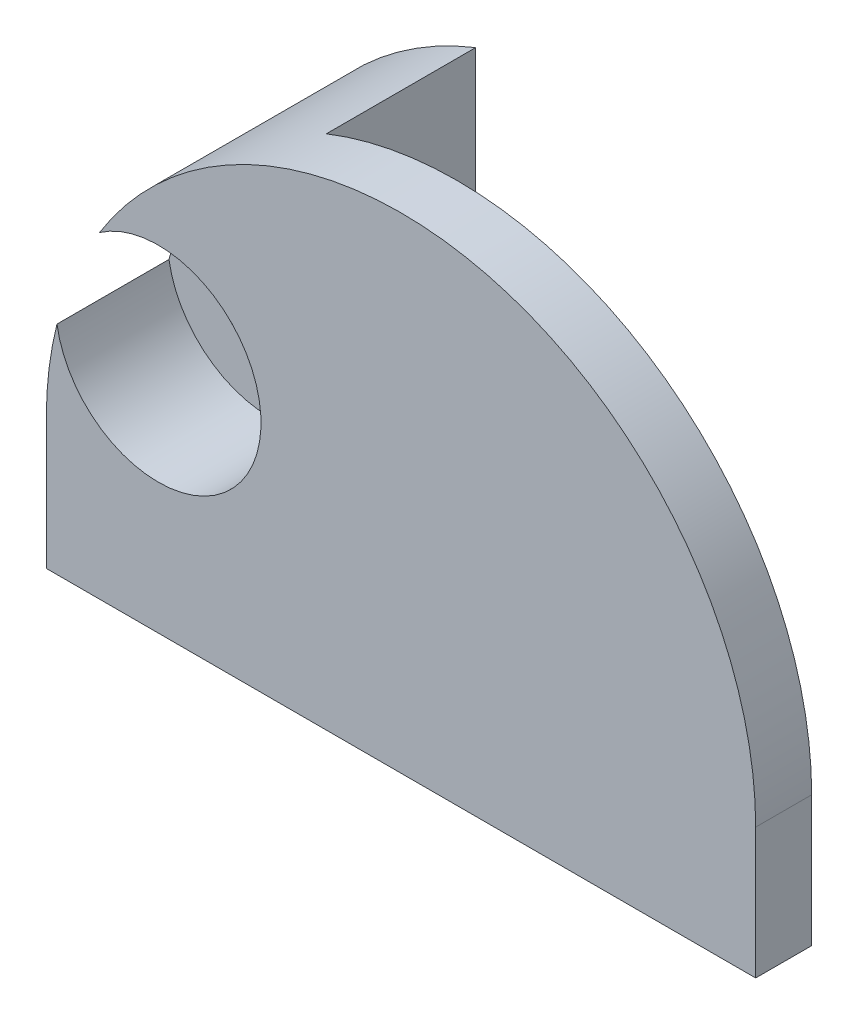
ISO-10303-21;
HEADER;
FILE_DESCRIPTION(('STEP AP214'),'2;1');
FILE_NAME('part.step','',(''),(''),'','','');
FILE_SCHEMA(('AUTOMOTIVE_DESIGN { 1 0 10303 214 1 1 1 1 }'));
ENDSEC;
DATA;
#1=APPLICATION_CONTEXT('core data for automotive mechanical design processes');
#2=APPLICATION_PROTOCOL_DEFINITION('international standard','automotive_design',2000,#1);
#3=PRODUCT_CONTEXT('',#1,'mechanical');
#4=PRODUCT('Part','Part','',(#3));
#5=PRODUCT_RELATED_PRODUCT_CATEGORY('part','',(#4));
#6=PRODUCT_DEFINITION_FORMATION('','',#4);
#7=PRODUCT_DEFINITION_CONTEXT('part definition',#1,'design');
#8=PRODUCT_DEFINITION('design','',#6,#7);
#9=PRODUCT_DEFINITION_SHAPE('','',#8);
#10=(LENGTH_UNIT() NAMED_UNIT(*) SI_UNIT(.MILLI.,.METRE.));
#11=(NAMED_UNIT(*) PLANE_ANGLE_UNIT() SI_UNIT($,.RADIAN.));
#12=(NAMED_UNIT(*) SI_UNIT($,.STERADIAN.) SOLID_ANGLE_UNIT());
#13=UNCERTAINTY_MEASURE_WITH_UNIT(LENGTH_MEASURE(1.E-05),#10,'distance_accuracy_value','');
#14=(GEOMETRIC_REPRESENTATION_CONTEXT(3) GLOBAL_UNCERTAINTY_ASSIGNED_CONTEXT((#13)) GLOBAL_UNIT_ASSIGNED_CONTEXT((#10,
#11,#12)) REPRESENTATION_CONTEXT('',''));
#15=CARTESIAN_POINT('',(0.,0.,0.));
#16=DIRECTION('',(0.,0.,1.));
#17=DIRECTION('',(1.,0.,0.));
#18=AXIS2_PLACEMENT_3D('',#15,#16,#17);
#19=CARTESIAN_POINT('',(-6.5,2.75,5.5));
#20=DIRECTION('',(0.,0.,-1.));
#21=DIRECTION('',(-1.,0.,0.));
#22=AXIS2_PLACEMENT_3D('',#19,#20,#21);
#23=CYLINDRICAL_SURFACE('',#22,1.5);
#24=CARTESIAN_POINT('',(-6.5,2.75,0.));
#25=DIRECTION('',(0.,0.,1.));
#26=DIRECTION('',(1.,0.,0.));
#27=AXIS2_PLACEMENT_3D('',#24,#25,#26);
#28=CIRCLE('',#27,1.5);
#29=CARTESIAN_POINT('',(-5.,2.75,0.));
#30=VERTEX_POINT('',#29);
#31=EDGE_CURVE('E122',#30,#30,#28,.T.);
#32=ORIENTED_EDGE('',*,*,#31,.F.);
#33=EDGE_LOOP('',(#32));
#34=FACE_BOUND('',#33,.T.);
#35=CARTESIAN_POINT('',(-6.5,2.75,2.5));
#36=DIRECTION('',(0.,0.,1.));
#37=DIRECTION('',(1.,0.,0.));
#38=AXIS2_PLACEMENT_3D('',#35,#36,#37);
#39=CIRCLE('',#38,1.5);
#40=CARTESIAN_POINT('',(-5.,2.75,2.5));
#41=VERTEX_POINT('',#40);
#42=EDGE_CURVE('E146',#41,#41,#39,.T.);
#43=ORIENTED_EDGE('',*,*,#42,.T.);
#44=EDGE_LOOP('',(#43));
#45=FACE_BOUND('',#44,.T.);
#46=ADVANCED_FACE('F33',(#34,#45),#23,.F.);
#47=CARTESIAN_POINT('',(9.5,-3.5,5.5));
#48=DIRECTION('',(-1.,0.,0.));
#49=DIRECTION('',(0.,0.,1.));
#50=AXIS2_PLACEMENT_3D('',#47,#48,#49);
#51=PLANE('',#50);
#52=DIRECTION('',(0.,-1.,0.));
#53=VECTOR('',#52,1.);
#54=CARTESIAN_POINT('',(9.5,-3.5,4.));
#55=LINE('',#54,#53);
#56=CARTESIAN_POINT('',(9.5,0.,4.));
#57=VERTEX_POINT('',#56);
#58=CARTESIAN_POINT('',(9.5,-3.5,4.));
#59=VERTEX_POINT('',#58);
#60=EDGE_CURVE('E144',#57,#59,#55,.T.);
#61=ORIENTED_EDGE('',*,*,#60,.F.);
#62=DIRECTION('',(0.,0.,-1.));
#63=VECTOR('',#62,1.);
#64=CARTESIAN_POINT('',(9.5,0.,5.5));
#65=LINE('',#64,#63);
#66=CARTESIAN_POINT('',(9.5,0.,5.5));
#67=VERTEX_POINT('',#66);
#68=EDGE_CURVE('E127',#67,#57,#65,.T.);
#69=ORIENTED_EDGE('',*,*,#68,.F.);
#70=DIRECTION('',(0.,1.,0.));
#71=VECTOR('',#70,1.);
#72=CARTESIAN_POINT('',(9.5,-3.5,5.5));
#73=LINE('',#72,#71);
#74=CARTESIAN_POINT('',(9.5,-3.5,5.5));
#75=VERTEX_POINT('',#74);
#76=EDGE_CURVE('E113',#75,#67,#73,.T.);
#77=ORIENTED_EDGE('',*,*,#76,.F.);
#78=DIRECTION('',(0.,0.,-1.));
#79=VECTOR('',#78,1.);
#80=CARTESIAN_POINT('',(9.5,-3.5,5.5));
#81=LINE('',#80,#79);
#82=EDGE_CURVE('E135',#75,#59,#81,.T.);
#83=ORIENTED_EDGE('',*,*,#82,.T.);
#84=EDGE_LOOP('',(#61,#69,#77,#83));
#85=FACE_BOUND('',#84,.T.);
#86=ADVANCED_FACE('F164',(#85),#51,.F.);
#87=CARTESIAN_POINT('',(0.,0.,5.5));
#88=DIRECTION('',(0.,0.,-1.));
#89=DIRECTION('',(-1.,0.,0.));
#90=AXIS2_PLACEMENT_3D('',#87,#88,#89);
#91=PLANE('',#90);
#92=CARTESIAN_POINT('',(0.,0.,5.5));
#93=DIRECTION('',(0.,0.,1.));
#94=DIRECTION('',(-1.,0.,0.));
#95=AXIS2_PLACEMENT_3D('',#92,#93,#94);
#96=CIRCLE('',#95,9.5);
#97=CARTESIAN_POINT('',(-8.07514655965584,5.00419904081347,5.5));
#98=VERTEX_POINT('',#97);
#99=EDGE_CURVE('E109',#67,#98,#96,.T.);
#100=ORIENTED_EDGE('',*,*,#99,.T.);
#101=CARTESIAN_POINT('',(-6.5,2.75,5.5));
#102=DIRECTION('',(0.,0.,1.));
#103=DIRECTION('',(1.,0.,0.));
#104=AXIS2_PLACEMENT_3D('',#101,#102,#103);
#105=CIRCLE('',#104,2.75);
#106=CARTESIAN_POINT('',(-9.2146903286754,2.31073195040359,5.5));
#107=VERTEX_POINT('',#106);
#108=EDGE_CURVE('E98',#107,#98,#105,.T.);
#109=ORIENTED_EDGE('',*,*,#108,.F.);
#110=CARTESIAN_POINT('',(-9.5,0.,5.5));
#111=VERTEX_POINT('',#110);
#112=EDGE_CURVE('E116',#107,#111,#96,.T.);
#113=ORIENTED_EDGE('',*,*,#112,.T.);
#114=DIRECTION('',(0.,-1.,0.));
#115=VECTOR('',#114,1.);
#116=CARTESIAN_POINT('',(-9.5,0.,5.5));
#117=LINE('',#116,#115);
#118=CARTESIAN_POINT('',(-9.5,-3.5,5.5));
#119=VERTEX_POINT('',#118);
#120=EDGE_CURVE('E115',#111,#119,#117,.T.);
#121=ORIENTED_EDGE('',*,*,#120,.T.);
#122=DIRECTION('',(1.,0.,0.));
#123=VECTOR('',#122,1.);
#124=CARTESIAN_POINT('',(-9.5,-3.5,5.5));
#125=LINE('',#124,#123);
#126=EDGE_CURVE('E118',#119,#75,#125,.T.);
#127=ORIENTED_EDGE('',*,*,#126,.T.);
#128=ORIENTED_EDGE('',*,*,#76,.T.);
#129=EDGE_LOOP('',(#100,#109,#113,#121,#127,#128));
#130=FACE_BOUND('',#129,.T.);
#131=ADVANCED_FACE('F111',(#130),#91,.F.);
#132=CARTESIAN_POINT('',(0.,0.,0.));
#133=DIRECTION('',(0.,0.,-1.));
#134=DIRECTION('',(-1.,0.,0.));
#135=AXIS2_PLACEMENT_3D('',#132,#133,#134);
#136=PLANE('',#135);
#137=DIRECTION('',(0.,1.,0.));
#138=VECTOR('',#137,1.);
#139=CARTESIAN_POINT('',(-3.5,11.0468272151536,0.));
#140=LINE('',#139,#138);
#141=CARTESIAN_POINT('',(-3.5,-3.5,0.));
#142=VERTEX_POINT('',#141);
#143=CARTESIAN_POINT('',(-3.5,8.83176086632785,0.));
#144=VERTEX_POINT('',#143);
#145=EDGE_CURVE('E172',#142,#144,#140,.T.);
#146=ORIENTED_EDGE('',*,*,#145,.F.);
#147=DIRECTION('',(1.,0.,0.));
#148=VECTOR('',#147,1.);
#149=CARTESIAN_POINT('',(-9.5,-3.5,0.));
#150=LINE('',#149,#148);
#151=CARTESIAN_POINT('',(-9.5,-3.5,0.));
#152=VERTEX_POINT('',#151);
#153=EDGE_CURVE('E120',#152,#142,#150,.T.);
#154=ORIENTED_EDGE('',*,*,#153,.F.);
#155=DIRECTION('',(0.,-1.,0.));
#156=VECTOR('',#155,1.);
#157=CARTESIAN_POINT('',(-9.5,0.,0.));
#158=LINE('',#157,#156);
#159=CARTESIAN_POINT('',(-9.5,0.,0.));
#160=VERTEX_POINT('',#159);
#161=EDGE_CURVE('E130',#160,#152,#158,.T.);
#162=ORIENTED_EDGE('',*,*,#161,.F.);
#163=CARTESIAN_POINT('',(0.,0.,0.));
#164=DIRECTION('',(0.,0.,1.));
#165=DIRECTION('',(-1.,0.,0.));
#166=AXIS2_PLACEMENT_3D('',#163,#164,#165);
#167=CIRCLE('',#166,9.5);
#168=EDGE_CURVE('E128',#144,#160,#167,.T.);
#169=ORIENTED_EDGE('',*,*,#168,.F.);
#170=EDGE_LOOP('',(#146,#154,#162,#169));
#171=FACE_BOUND('',#170,.T.);
#172=ORIENTED_EDGE('',*,*,#31,.T.);
#173=EDGE_LOOP('',(#172));
#174=FACE_BOUND('',#173,.T.);
#175=ADVANCED_FACE('F203',(#171,#174),#136,.T.);
#176=CARTESIAN_POINT('',(0.,0.,5.5));
#177=DIRECTION('',(0.,0.,-1.));
#178=DIRECTION('',(-1.,0.,0.));
#179=AXIS2_PLACEMENT_3D('',#176,#177,#178);
#180=CYLINDRICAL_SURFACE('',#179,9.5);
#181=CARTESIAN_POINT('',(0.,0.,2.5));
#182=DIRECTION('',(0.,0.,1.));
#183=DIRECTION('',(1.,0.,0.));
#184=AXIS2_PLACEMENT_3D('',#181,#182,#183);
#185=CIRCLE('',#184,9.5);
#186=CARTESIAN_POINT('',(-8.07514655965584,5.00419904081347,2.5));
#187=VERTEX_POINT('',#186);
#188=CARTESIAN_POINT('',(-9.2146903286754,2.31073195040359,2.5));
#189=VERTEX_POINT('',#188);
#190=EDGE_CURVE('E110',#187,#189,#185,.T.);
#191=ORIENTED_EDGE('',*,*,#190,.F.);
#192=DIRECTION('',(0.,0.,1.));
#193=VECTOR('',#192,1.);
#194=CARTESIAN_POINT('',(-8.07514655965584,5.00419904081347,4.));
#195=LINE('',#194,#193);
#196=EDGE_CURVE('E11',#187,#98,#195,.T.);
#197=ORIENTED_EDGE('',*,*,#196,.T.);
#198=ORIENTED_EDGE('',*,*,#99,.F.);
#199=ORIENTED_EDGE('',*,*,#68,.T.);
#200=CARTESIAN_POINT('',(0.,0.,4.));
#201=DIRECTION('',(0.,0.,-1.));
#202=DIRECTION('',(-1.,0.,0.));
#203=AXIS2_PLACEMENT_3D('',#200,#201,#202);
#204=CIRCLE('',#203,9.5);
#205=CARTESIAN_POINT('',(-3.5,8.83176086632785,4.));
#206=VERTEX_POINT('',#205);
#207=EDGE_CURVE('E55',#206,#57,#204,.T.);
#208=ORIENTED_EDGE('',*,*,#207,.F.);
#209=DIRECTION('',(0.,0.,-1.));
#210=VECTOR('',#209,1.);
#211=CARTESIAN_POINT('',(-3.5,8.83176086632785,5.5));
#212=LINE('',#211,#210);
#213=EDGE_CURVE('E166',#206,#144,#212,.T.);
#214=ORIENTED_EDGE('',*,*,#213,.T.);
#215=ORIENTED_EDGE('',*,*,#168,.T.);
#216=DIRECTION('',(0.,0.,-1.));
#217=VECTOR('',#216,1.);
#218=CARTESIAN_POINT('',(-9.5,0.,5.5));
#219=LINE('',#218,#217);
#220=EDGE_CURVE('E141',#111,#160,#219,.T.);
#221=ORIENTED_EDGE('',*,*,#220,.F.);
#222=ORIENTED_EDGE('',*,*,#112,.F.);
#223=DIRECTION('',(0.,0.,1.));
#224=VECTOR('',#223,1.);
#225=CARTESIAN_POINT('',(-9.2146903286754,2.31073195040359,4.));
#226=LINE('',#225,#224);
#227=EDGE_CURVE('E41',#107,#189,#226,.F.);
#228=ORIENTED_EDGE('',*,*,#227,.T.);
#229=EDGE_LOOP('',(#191,#197,#198,#199,#208,#214,#215,#221,#222,#228));
#230=FACE_BOUND('',#229,.T.);
#231=ADVANCED_FACE('F35',(#230),#180,.T.);
#232=CARTESIAN_POINT('',(-9.5,0.,5.5));
#233=DIRECTION('',(1.,0.,0.));
#234=DIRECTION('',(0.,0.,-1.));
#235=AXIS2_PLACEMENT_3D('',#232,#233,#234);
#236=PLANE('',#235);
#237=ORIENTED_EDGE('',*,*,#161,.T.);
#238=DIRECTION('',(0.,0.,-1.));
#239=VECTOR('',#238,1.);
#240=CARTESIAN_POINT('',(-9.5,-3.5,5.5));
#241=LINE('',#240,#239);
#242=EDGE_CURVE('E138',#119,#152,#241,.T.);
#243=ORIENTED_EDGE('',*,*,#242,.F.);
#244=ORIENTED_EDGE('',*,*,#120,.F.);
#245=ORIENTED_EDGE('',*,*,#220,.T.);
#246=EDGE_LOOP('',(#237,#243,#244,#245));
#247=FACE_BOUND('',#246,.T.);
#248=ADVANCED_FACE('F152',(#247),#236,.F.);
#249=CARTESIAN_POINT('',(-9.5,-3.5,5.5));
#250=DIRECTION('',(0.,1.,0.));
#251=DIRECTION('',(0.,0.,1.));
#252=AXIS2_PLACEMENT_3D('',#249,#250,#251);
#253=PLANE('',#252);
#254=ORIENTED_EDGE('',*,*,#153,.T.);
#255=DIRECTION('',(0.,0.,-1.));
#256=VECTOR('',#255,1.);
#257=CARTESIAN_POINT('',(-3.5,-3.5,4.));
#258=LINE('',#257,#256);
#259=CARTESIAN_POINT('',(-3.5,-3.5,4.));
#260=VERTEX_POINT('',#259);
#261=EDGE_CURVE('E168',#260,#142,#258,.T.);
#262=ORIENTED_EDGE('',*,*,#261,.F.);
#263=DIRECTION('',(-1.,0.,0.));
#264=VECTOR('',#263,1.);
#265=CARTESIAN_POINT('',(9.5,-3.5,4.));
#266=LINE('',#265,#264);
#267=EDGE_CURVE('E162',#59,#260,#266,.T.);
#268=ORIENTED_EDGE('',*,*,#267,.F.);
#269=ORIENTED_EDGE('',*,*,#82,.F.);
#270=ORIENTED_EDGE('',*,*,#126,.F.);
#271=ORIENTED_EDGE('',*,*,#242,.T.);
#272=EDGE_LOOP('',(#254,#262,#268,#269,#270,#271));
#273=FACE_BOUND('',#272,.T.);
#274=ADVANCED_FACE('F158',(#273),#253,.F.);
#275=CARTESIAN_POINT('',(-3.5,11.0468272151536,4.));
#276=DIRECTION('',(-1.,0.,0.));
#277=DIRECTION('',(0.,-1.,0.));
#278=AXIS2_PLACEMENT_3D('',#275,#276,#277);
#279=PLANE('',#278);
#280=DIRECTION('',(0.,1.,0.));
#281=VECTOR('',#280,1.);
#282=CARTESIAN_POINT('',(-3.5,11.0468272151536,4.));
#283=LINE('',#282,#281);
#284=EDGE_CURVE('E174',#260,#206,#283,.T.);
#285=ORIENTED_EDGE('',*,*,#284,.F.);
#286=ORIENTED_EDGE('',*,*,#261,.T.);
#287=ORIENTED_EDGE('',*,*,#145,.T.);
#288=ORIENTED_EDGE('',*,*,#213,.F.);
#289=EDGE_LOOP('',(#285,#286,#287,#288));
#290=FACE_BOUND('',#289,.T.);
#291=ADVANCED_FACE('F199',(#290),#279,.F.);
#292=CARTESIAN_POINT('',(0.,0.,4.));
#293=DIRECTION('',(0.,0.,-1.));
#294=DIRECTION('',(-1.,0.,0.));
#295=AXIS2_PLACEMENT_3D('',#292,#293,#294);
#296=PLANE('',#295);
#297=ORIENTED_EDGE('',*,*,#207,.T.);
#298=ORIENTED_EDGE('',*,*,#60,.T.);
#299=ORIENTED_EDGE('',*,*,#267,.T.);
#300=ORIENTED_EDGE('',*,*,#284,.T.);
#301=EDGE_LOOP('',(#297,#298,#299,#300));
#302=FACE_BOUND('',#301,.T.);
#303=ADVANCED_FACE('F185',(#302),#296,.T.);
#304=CARTESIAN_POINT('',(-6.5,2.75,2.5));
#305=DIRECTION('',(0.,0.,1.));
#306=DIRECTION('',(1.,0.,0.));
#307=AXIS2_PLACEMENT_3D('',#304,#305,#306);
#308=CYLINDRICAL_SURFACE('',#307,2.75);
#309=CARTESIAN_POINT('',(-6.5,2.75,2.5));
#310=DIRECTION('',(0.,0.,1.));
#311=DIRECTION('',(1.,0.,0.));
#312=AXIS2_PLACEMENT_3D('',#309,#310,#311);
#313=CIRCLE('',#312,2.75);
#314=EDGE_CURVE('E47',#189,#187,#313,.T.);
#315=ORIENTED_EDGE('',*,*,#314,.F.);
#316=ORIENTED_EDGE('',*,*,#227,.F.);
#317=ORIENTED_EDGE('',*,*,#108,.T.);
#318=ORIENTED_EDGE('',*,*,#196,.F.);
#319=EDGE_LOOP('',(#315,#316,#317,#318));
#320=FACE_BOUND('',#319,.T.);
#321=ADVANCED_FACE('F99',(#320),#308,.F.);
#322=CARTESIAN_POINT('',(-6.5,2.75,2.5));
#323=DIRECTION('',(0.,0.,1.));
#324=DIRECTION('',(1.,0.,0.));
#325=AXIS2_PLACEMENT_3D('',#322,#323,#324);
#326=PLANE('',#325);
#327=ORIENTED_EDGE('',*,*,#42,.F.);
#328=EDGE_LOOP('',(#327));
#329=FACE_BOUND('',#328,.T.);
#330=ORIENTED_EDGE('',*,*,#190,.T.);
#331=ORIENTED_EDGE('',*,*,#314,.T.);
#332=EDGE_LOOP('',(#330,#331));
#333=FACE_BOUND('',#332,.T.);
#334=ADVANCED_FACE('F178',(#329,#333),#326,.T.);
#335=CLOSED_SHELL('',(#46,#86,#131,#175,#231,#248,#274,#291,#303,#321,#334));
#336=MANIFOLD_SOLID_BREP('B2',#335);
#337=ADVANCED_BREP_SHAPE_REPRESENTATION('',(#18,#336),#14);
#338=SHAPE_DEFINITION_REPRESENTATION(#9,#337);
ENDSEC;
END-ISO-10303-21;
